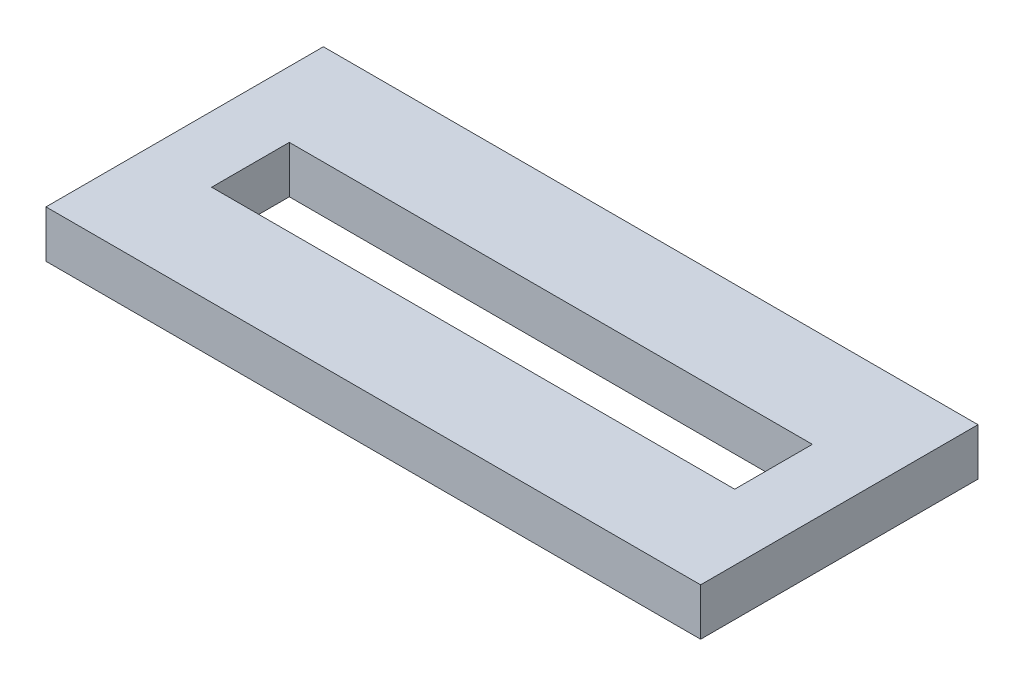
ISO-10303-21;
HEADER;
FILE_DESCRIPTION(('STEP AP214'),'2;1');
FILE_NAME('part.step','',(''),(''),'','','');
FILE_SCHEMA(('AUTOMOTIVE_DESIGN { 1 0 10303 214 1 1 1 1 }'));
ENDSEC;
DATA;
#1=APPLICATION_CONTEXT('core data for automotive mechanical design processes');
#2=APPLICATION_PROTOCOL_DEFINITION('international standard','automotive_design',2000,#1);
#3=PRODUCT_CONTEXT('',#1,'mechanical');
#4=PRODUCT('Part','Part','',(#3));
#5=PRODUCT_RELATED_PRODUCT_CATEGORY('part','',(#4));
#6=PRODUCT_DEFINITION_FORMATION('','',#4);
#7=PRODUCT_DEFINITION_CONTEXT('part definition',#1,'design');
#8=PRODUCT_DEFINITION('design','',#6,#7);
#9=PRODUCT_DEFINITION_SHAPE('','',#8);
#10=(LENGTH_UNIT() NAMED_UNIT(*) SI_UNIT(.MILLI.,.METRE.));
#11=(NAMED_UNIT(*) PLANE_ANGLE_UNIT() SI_UNIT($,.RADIAN.));
#12=(NAMED_UNIT(*) SI_UNIT($,.STERADIAN.) SOLID_ANGLE_UNIT());
#13=UNCERTAINTY_MEASURE_WITH_UNIT(LENGTH_MEASURE(1.E-05),#10,'distance_accuracy_value','');
#14=(GEOMETRIC_REPRESENTATION_CONTEXT(3) GLOBAL_UNCERTAINTY_ASSIGNED_CONTEXT((#13)) GLOBAL_UNIT_ASSIGNED_CONTEXT((#10,
#11,#12)) REPRESENTATION_CONTEXT('',''));
#15=CARTESIAN_POINT('',(0.,0.,0.));
#16=DIRECTION('',(0.,0.,1.));
#17=DIRECTION('',(1.,0.,0.));
#18=AXIS2_PLACEMENT_3D('',#15,#16,#17);
#19=CARTESIAN_POINT('',(-36.046875,4.25,-10.171875));
#20=DIRECTION('',(1.,0.,0.));
#21=DIRECTION('',(0.,0.,-1.));
#22=AXIS2_PLACEMENT_3D('',#19,#20,#21);
#23=PLANE('',#22);
#24=DIRECTION('',(0.,0.,1.));
#25=VECTOR('',#24,1.);
#26=CARTESIAN_POINT('',(-36.046875,0.,-10.171875));
#27=LINE('',#26,#25);
#28=CARTESIAN_POINT('',(-36.046875,0.,-10.171875));
#29=VERTEX_POINT('',#28);
#30=CARTESIAN_POINT('',(-36.046875,0.,14.828125));
#31=VERTEX_POINT('',#30);
#32=EDGE_CURVE('E151',#29,#31,#27,.T.);
#33=ORIENTED_EDGE('',*,*,#32,.T.);
#34=DIRECTION('',(0.,-1.,0.));
#35=VECTOR('',#34,1.);
#36=CARTESIAN_POINT('',(-36.046875,4.25,14.828125));
#37=LINE('',#36,#35);
#38=CARTESIAN_POINT('',(-36.046875,4.25,14.828125));
#39=VERTEX_POINT('',#38);
#40=EDGE_CURVE('E11',#39,#31,#37,.T.);
#41=ORIENTED_EDGE('',*,*,#40,.F.);
#42=DIRECTION('',(0.,0.,1.));
#43=VECTOR('',#42,1.);
#44=CARTESIAN_POINT('',(-36.046875,4.25,-10.171875));
#45=LINE('',#44,#43);
#46=CARTESIAN_POINT('',(-36.046875,4.25,-10.171875));
#47=VERTEX_POINT('',#46);
#48=EDGE_CURVE('E157',#47,#39,#45,.T.);
#49=ORIENTED_EDGE('',*,*,#48,.F.);
#50=DIRECTION('',(0.,-1.,0.));
#51=VECTOR('',#50,1.);
#52=CARTESIAN_POINT('',(-36.046875,4.25,-10.171875));
#53=LINE('',#52,#51);
#54=EDGE_CURVE('E171',#47,#29,#53,.T.);
#55=ORIENTED_EDGE('',*,*,#54,.T.);
#56=EDGE_LOOP('',(#33,#41,#49,#55));
#57=FACE_BOUND('',#56,.T.);
#58=ADVANCED_FACE('F43',(#57),#23,.F.);
#59=CARTESIAN_POINT('',(-36.046875,4.25,14.828125));
#60=DIRECTION('',(0.,0.,-1.));
#61=DIRECTION('',(-1.,0.,0.));
#62=AXIS2_PLACEMENT_3D('',#59,#60,#61);
#63=PLANE('',#62);
#64=DIRECTION('',(1.,0.,0.));
#65=VECTOR('',#64,1.);
#66=CARTESIAN_POINT('',(-36.046875,0.,14.828125));
#67=LINE('',#66,#65);
#68=CARTESIAN_POINT('',(22.953125,0.,14.828125));
#69=VERTEX_POINT('',#68);
#70=EDGE_CURVE('E175',#31,#69,#67,.T.);
#71=ORIENTED_EDGE('',*,*,#70,.T.);
#72=DIRECTION('',(0.,-1.,0.));
#73=VECTOR('',#72,1.);
#74=CARTESIAN_POINT('',(22.953125,4.25,14.828125));
#75=LINE('',#74,#73);
#76=CARTESIAN_POINT('',(22.953125,4.25,14.828125));
#77=VERTEX_POINT('',#76);
#78=EDGE_CURVE('E51',#77,#69,#75,.T.);
#79=ORIENTED_EDGE('',*,*,#78,.F.);
#80=DIRECTION('',(1.,0.,0.));
#81=VECTOR('',#80,1.);
#82=CARTESIAN_POINT('',(-36.046875,4.25,14.828125));
#83=LINE('',#82,#81);
#84=EDGE_CURVE('E161',#39,#77,#83,.T.);
#85=ORIENTED_EDGE('',*,*,#84,.F.);
#86=ORIENTED_EDGE('',*,*,#40,.T.);
#87=EDGE_LOOP('',(#71,#79,#85,#86));
#88=FACE_BOUND('',#87,.T.);
#89=ADVANCED_FACE('F209',(#88),#63,.F.);
#90=CARTESIAN_POINT('',(22.953125,4.25,-10.171875));
#91=DIRECTION('',(-1.,0.,0.));
#92=DIRECTION('',(0.,0.,1.));
#93=AXIS2_PLACEMENT_3D('',#90,#91,#92);
#94=PLANE('',#93);
#95=DIRECTION('',(0.,0.,-1.));
#96=VECTOR('',#95,1.);
#97=CARTESIAN_POINT('',(22.953125,0.,-10.171875));
#98=LINE('',#97,#96);
#99=CARTESIAN_POINT('',(22.953125,0.,-10.171875));
#100=VERTEX_POINT('',#99);
#101=EDGE_CURVE('E178',#69,#100,#98,.T.);
#102=ORIENTED_EDGE('',*,*,#101,.T.);
#103=DIRECTION('',(0.,-1.,0.));
#104=VECTOR('',#103,1.);
#105=CARTESIAN_POINT('',(22.953125,4.25,-10.171875));
#106=LINE('',#105,#104);
#107=CARTESIAN_POINT('',(22.953125,4.25,-10.171875));
#108=VERTEX_POINT('',#107);
#109=EDGE_CURVE('E186',#108,#100,#106,.T.);
#110=ORIENTED_EDGE('',*,*,#109,.F.);
#111=DIRECTION('',(0.,0.,-1.));
#112=VECTOR('',#111,1.);
#113=CARTESIAN_POINT('',(22.953125,4.25,-10.171875));
#114=LINE('',#113,#112);
#115=EDGE_CURVE('E165',#77,#108,#114,.T.);
#116=ORIENTED_EDGE('',*,*,#115,.F.);
#117=ORIENTED_EDGE('',*,*,#78,.T.);
#118=EDGE_LOOP('',(#102,#110,#116,#117));
#119=FACE_BOUND('',#118,.T.);
#120=ADVANCED_FACE('F195',(#119),#94,.F.);
#121=CARTESIAN_POINT('',(-36.046875,4.25,-10.171875));
#122=DIRECTION('',(0.,0.,1.));
#123=DIRECTION('',(1.,0.,0.));
#124=AXIS2_PLACEMENT_3D('',#121,#122,#123);
#125=PLANE('',#124);
#126=DIRECTION('',(-1.,0.,0.));
#127=VECTOR('',#126,1.);
#128=CARTESIAN_POINT('',(-36.046875,0.,-10.171875));
#129=LINE('',#128,#127);
#130=EDGE_CURVE('E162',#100,#29,#129,.T.);
#131=ORIENTED_EDGE('',*,*,#130,.T.);
#132=ORIENTED_EDGE('',*,*,#54,.F.);
#133=DIRECTION('',(-1.,0.,0.));
#134=VECTOR('',#133,1.);
#135=CARTESIAN_POINT('',(-36.046875,4.25,-10.171875));
#136=LINE('',#135,#134);
#137=EDGE_CURVE('E168',#108,#47,#136,.T.);
#138=ORIENTED_EDGE('',*,*,#137,.F.);
#139=ORIENTED_EDGE('',*,*,#109,.T.);
#140=EDGE_LOOP('',(#131,#132,#138,#139));
#141=FACE_BOUND('',#140,.T.);
#142=ADVANCED_FACE('F202',(#141),#125,.F.);
#143=CARTESIAN_POINT('',(0.,4.25,0.));
#144=DIRECTION('',(0.,1.,0.));
#145=DIRECTION('',(0.,0.,1.));
#146=AXIS2_PLACEMENT_3D('',#143,#144,#145);
#147=PLANE('',#146);
#148=DIRECTION('',(0.,0.,1.));
#149=VECTOR('',#148,1.);
#150=CARTESIAN_POINT('',(-30.1177679221644,4.25,-1.171875));
#151=LINE('',#150,#149);
#152=CARTESIAN_POINT('',(-30.1177679221644,4.25,-1.171875));
#153=VERTEX_POINT('',#152);
#154=CARTESIAN_POINT('',(-30.1177679221644,4.25,5.828125));
#155=VERTEX_POINT('',#154);
#156=EDGE_CURVE('E58',#153,#155,#151,.T.);
#157=ORIENTED_EDGE('',*,*,#156,.F.);
#158=DIRECTION('',(-1.,0.,0.));
#159=VECTOR('',#158,1.);
#160=CARTESIAN_POINT('',(-30.1177679221644,4.25,-1.171875));
#161=LINE('',#160,#159);
#162=CARTESIAN_POINT('',(17.0240179221644,4.25,-1.171875));
#163=VERTEX_POINT('',#162);
#164=EDGE_CURVE('E129',#163,#153,#161,.T.);
#165=ORIENTED_EDGE('',*,*,#164,.F.);
#166=DIRECTION('',(0.,0.,-1.));
#167=VECTOR('',#166,1.);
#168=CARTESIAN_POINT('',(17.0240179221644,4.25,-1.171875));
#169=LINE('',#168,#167);
#170=CARTESIAN_POINT('',(17.0240179221644,4.25,5.828125));
#171=VERTEX_POINT('',#170);
#172=EDGE_CURVE('E133',#171,#163,#169,.T.);
#173=ORIENTED_EDGE('',*,*,#172,.F.);
#174=DIRECTION('',(1.,0.,0.));
#175=VECTOR('',#174,1.);
#176=CARTESIAN_POINT('',(-30.1177679221644,4.25,5.828125));
#177=LINE('',#176,#175);
#178=EDGE_CURVE('E142',#155,#171,#177,.T.);
#179=ORIENTED_EDGE('',*,*,#178,.F.);
#180=EDGE_LOOP('',(#157,#165,#173,#179));
#181=FACE_BOUND('',#180,.T.);
#182=ORIENTED_EDGE('',*,*,#48,.T.);
#183=ORIENTED_EDGE('',*,*,#84,.T.);
#184=ORIENTED_EDGE('',*,*,#115,.T.);
#185=ORIENTED_EDGE('',*,*,#137,.T.);
#186=EDGE_LOOP('',(#182,#183,#184,#185));
#187=FACE_BOUND('',#186,.T.);
#188=ADVANCED_FACE('F208',(#181,#187),#147,.T.);
#189=CARTESIAN_POINT('',(0.,0.,0.));
#190=DIRECTION('',(0.,1.,0.));
#191=DIRECTION('',(0.,0.,1.));
#192=AXIS2_PLACEMENT_3D('',#189,#190,#191);
#193=PLANE('',#192);
#194=DIRECTION('',(-1.,0.,0.));
#195=VECTOR('',#194,1.);
#196=CARTESIAN_POINT('',(-30.1177679221644,0.,-1.171875));
#197=LINE('',#196,#195);
#198=CARTESIAN_POINT('',(17.0240179221644,0.,-1.171875));
#199=VERTEX_POINT('',#198);
#200=CARTESIAN_POINT('',(-30.1177679221644,0.,-1.171875));
#201=VERTEX_POINT('',#200);
#202=EDGE_CURVE('E117',#199,#201,#197,.T.);
#203=ORIENTED_EDGE('',*,*,#202,.T.);
#204=DIRECTION('',(0.,0.,1.));
#205=VECTOR('',#204,1.);
#206=CARTESIAN_POINT('',(-30.1177679221644,0.,-1.171875));
#207=LINE('',#206,#205);
#208=CARTESIAN_POINT('',(-30.1177679221644,0.,5.828125));
#209=VERTEX_POINT('',#208);
#210=EDGE_CURVE('E110',#201,#209,#207,.T.);
#211=ORIENTED_EDGE('',*,*,#210,.T.);
#212=DIRECTION('',(1.,0.,0.));
#213=VECTOR('',#212,1.);
#214=CARTESIAN_POINT('',(-30.1177679221644,0.,5.828125));
#215=LINE('',#214,#213);
#216=CARTESIAN_POINT('',(17.0240179221644,0.,5.828125));
#217=VERTEX_POINT('',#216);
#218=EDGE_CURVE('E120',#209,#217,#215,.T.);
#219=ORIENTED_EDGE('',*,*,#218,.T.);
#220=DIRECTION('',(0.,0.,-1.));
#221=VECTOR('',#220,1.);
#222=CARTESIAN_POINT('',(17.0240179221644,0.,-1.171875));
#223=LINE('',#222,#221);
#224=EDGE_CURVE('E66',#217,#199,#223,.T.);
#225=ORIENTED_EDGE('',*,*,#224,.T.);
#226=EDGE_LOOP('',(#203,#211,#219,#225));
#227=FACE_BOUND('',#226,.T.);
#228=ORIENTED_EDGE('',*,*,#32,.F.);
#229=ORIENTED_EDGE('',*,*,#130,.F.);
#230=ORIENTED_EDGE('',*,*,#101,.F.);
#231=ORIENTED_EDGE('',*,*,#70,.F.);
#232=EDGE_LOOP('',(#228,#229,#230,#231));
#233=FACE_BOUND('',#232,.T.);
#234=ADVANCED_FACE('F125',(#227,#233),#193,.F.);
#235=CARTESIAN_POINT('',(-30.1177679221644,0.,-1.171875));
#236=DIRECTION('',(-1.,0.,0.));
#237=DIRECTION('',(0.,0.,1.));
#238=AXIS2_PLACEMENT_3D('',#235,#236,#237);
#239=PLANE('',#238);
#240=ORIENTED_EDGE('',*,*,#156,.T.);
#241=DIRECTION('',(0.,1.,0.));
#242=VECTOR('',#241,1.);
#243=CARTESIAN_POINT('',(-30.1177679221644,0.,5.828125));
#244=LINE('',#243,#242);
#245=EDGE_CURVE('E106',#209,#155,#244,.T.);
#246=ORIENTED_EDGE('',*,*,#245,.F.);
#247=ORIENTED_EDGE('',*,*,#210,.F.);
#248=DIRECTION('',(0.,1.,0.));
#249=VECTOR('',#248,1.);
#250=CARTESIAN_POINT('',(-30.1177679221644,0.,-1.171875));
#251=LINE('',#250,#249);
#252=EDGE_CURVE('E148',#201,#153,#251,.T.);
#253=ORIENTED_EDGE('',*,*,#252,.T.);
#254=EDGE_LOOP('',(#240,#246,#247,#253));
#255=FACE_BOUND('',#254,.T.);
#256=ADVANCED_FACE('F108',(#255),#239,.F.);
#257=CARTESIAN_POINT('',(-30.1177679221644,0.,-1.171875));
#258=DIRECTION('',(0.,0.,-1.));
#259=DIRECTION('',(-1.,0.,0.));
#260=AXIS2_PLACEMENT_3D('',#257,#258,#259);
#261=PLANE('',#260);
#262=ORIENTED_EDGE('',*,*,#164,.T.);
#263=ORIENTED_EDGE('',*,*,#252,.F.);
#264=ORIENTED_EDGE('',*,*,#202,.F.);
#265=DIRECTION('',(0.,1.,0.));
#266=VECTOR('',#265,1.);
#267=CARTESIAN_POINT('',(17.0240179221644,0.,-1.171875));
#268=LINE('',#267,#266);
#269=EDGE_CURVE('E152',#199,#163,#268,.T.);
#270=ORIENTED_EDGE('',*,*,#269,.T.);
#271=EDGE_LOOP('',(#262,#263,#264,#270));
#272=FACE_BOUND('',#271,.T.);
#273=ADVANCED_FACE('F226',(#272),#261,.F.);
#274=CARTESIAN_POINT('',(17.0240179221644,0.,-1.171875));
#275=DIRECTION('',(1.,0.,0.));
#276=DIRECTION('',(0.,0.,-1.));
#277=AXIS2_PLACEMENT_3D('',#274,#275,#276);
#278=PLANE('',#277);
#279=ORIENTED_EDGE('',*,*,#172,.T.);
#280=ORIENTED_EDGE('',*,*,#269,.F.);
#281=ORIENTED_EDGE('',*,*,#224,.F.);
#282=DIRECTION('',(0.,1.,0.));
#283=VECTOR('',#282,1.);
#284=CARTESIAN_POINT('',(17.0240179221644,0.,5.828125));
#285=LINE('',#284,#283);
#286=EDGE_CURVE('E116',#217,#171,#285,.T.);
#287=ORIENTED_EDGE('',*,*,#286,.T.);
#288=EDGE_LOOP('',(#279,#280,#281,#287));
#289=FACE_BOUND('',#288,.T.);
#290=ADVANCED_FACE('F229',(#289),#278,.F.);
#291=CARTESIAN_POINT('',(-30.1177679221644,0.,5.828125));
#292=DIRECTION('',(0.,0.,1.));
#293=DIRECTION('',(1.,0.,0.));
#294=AXIS2_PLACEMENT_3D('',#291,#292,#293);
#295=PLANE('',#294);
#296=ORIENTED_EDGE('',*,*,#178,.T.);
#297=ORIENTED_EDGE('',*,*,#286,.F.);
#298=ORIENTED_EDGE('',*,*,#218,.F.);
#299=ORIENTED_EDGE('',*,*,#245,.T.);
#300=EDGE_LOOP('',(#296,#297,#298,#299));
#301=FACE_BOUND('',#300,.T.);
#302=ADVANCED_FACE('F121',(#301),#295,.F.);
#303=CLOSED_SHELL('',(#58,#89,#120,#142,#188,#234,#256,#273,#290,#302));
#304=MANIFOLD_SOLID_BREP('B2',#303);
#305=ADVANCED_BREP_SHAPE_REPRESENTATION('',(#18,#304),#14);
#306=SHAPE_DEFINITION_REPRESENTATION(#9,#305);
ENDSEC;
END-ISO-10303-21;
